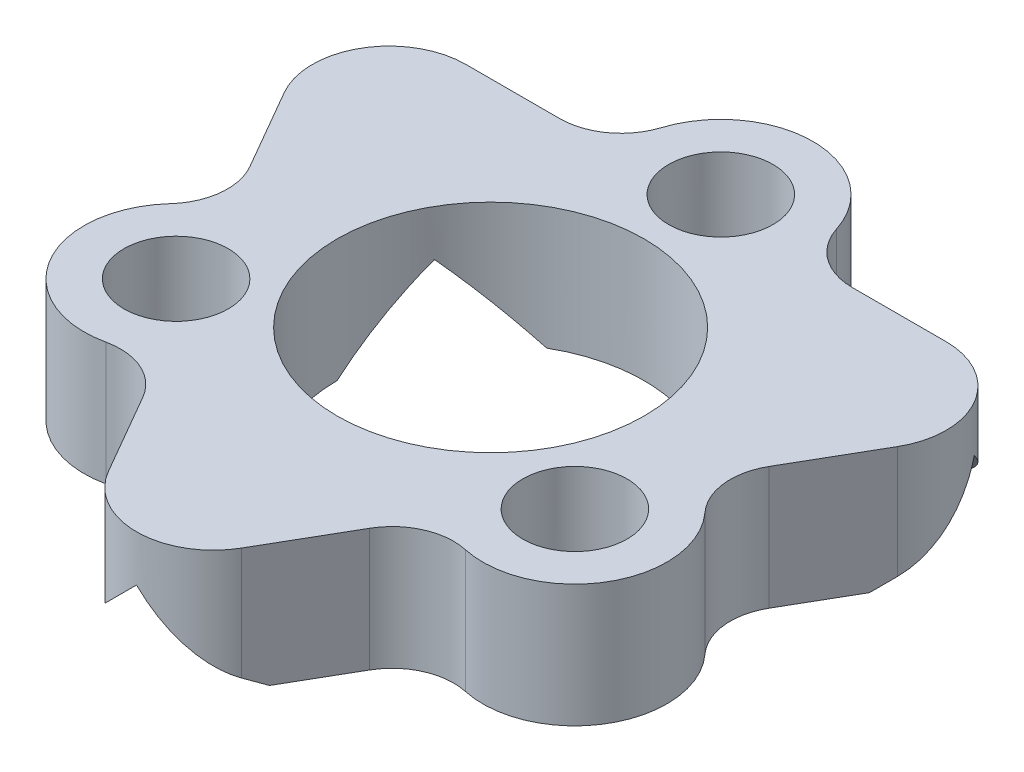
ISO-10303-21;
HEADER;
FILE_DESCRIPTION(('STEP AP214'),'2;1');
FILE_NAME('part.step','',(''),(''),'','','');
FILE_SCHEMA(('AUTOMOTIVE_DESIGN { 1 0 10303 214 1 1 1 1 }'));
ENDSEC;
DATA;
#1=APPLICATION_CONTEXT('core data for automotive mechanical design processes');
#2=APPLICATION_PROTOCOL_DEFINITION('international standard','automotive_design',2000,#1);
#3=PRODUCT_CONTEXT('',#1,'mechanical');
#4=PRODUCT('Part','Part','',(#3));
#5=PRODUCT_RELATED_PRODUCT_CATEGORY('part','',(#4));
#6=PRODUCT_DEFINITION_FORMATION('','',#4);
#7=PRODUCT_DEFINITION_CONTEXT('part definition',#1,'design');
#8=PRODUCT_DEFINITION('design','',#6,#7);
#9=PRODUCT_DEFINITION_SHAPE('','',#8);
#10=(LENGTH_UNIT() NAMED_UNIT(*) SI_UNIT(.MILLI.,.METRE.));
#11=(NAMED_UNIT(*) PLANE_ANGLE_UNIT() SI_UNIT($,.RADIAN.));
#12=(NAMED_UNIT(*) SI_UNIT($,.STERADIAN.) SOLID_ANGLE_UNIT());
#13=UNCERTAINTY_MEASURE_WITH_UNIT(LENGTH_MEASURE(1.E-05),#10,'distance_accuracy_value','');
#14=(GEOMETRIC_REPRESENTATION_CONTEXT(3) GLOBAL_UNCERTAINTY_ASSIGNED_CONTEXT((#13)) GLOBAL_UNIT_ASSIGNED_CONTEXT((#10,
#11,#12)) REPRESENTATION_CONTEXT('',''));
#15=CARTESIAN_POINT('',(0.,0.,0.));
#16=DIRECTION('',(0.,0.,1.));
#17=DIRECTION('',(1.,0.,0.));
#18=AXIS2_PLACEMENT_3D('',#15,#16,#17);
#19=CARTESIAN_POINT('',(11.5265487560121,0.,8.75540769010716));
#20=DIRECTION('',(0.,-1.,0.));
#21=DIRECTION('',(0.,0.,-1.));
#22=AXIS2_PLACEMENT_3D('',#19,#20,#21);
#23=PLANE('',#22);
#24=DIRECTION('',(0.866025403784443,0.,-0.499999999999992));
#25=VECTOR('',#24,1.);
#26=CARTESIAN_POINT('',(8.59904588082546,0.,-4.20939363476538));
#27=LINE('',#26,#25);
#28=CARTESIAN_POINT('',(8.59904588082546,0.,-4.20939363476538));
#29=VERTEX_POINT('',#28);
#30=CARTESIAN_POINT('',(13.2540458808258,0.,-6.89695913784322));
#31=VERTEX_POINT('',#30);
#32=EDGE_CURVE('E226',#29,#31,#27,.T.);
#33=ORIENTED_EDGE('',*,*,#32,.F.);
#34=CARTESIAN_POINT('',(6.09904588082545,0.,0.120733384156847));
#35=DIRECTION('',(0.,1.,0.));
#36=DIRECTION('',(0.,0.,1.));
#37=AXIS2_PLACEMENT_3D('',#34,#35,#36);
#38=CIRCLE('',#37,5.00000000000003);
#39=CARTESIAN_POINT('',(3.59904588082543,0.,-4.20939363476537));
#40=VERTEX_POINT('',#39);
#41=EDGE_CURVE('E222',#29,#40,#38,.T.);
#42=ORIENTED_EDGE('',*,*,#41,.T.);
#43=DIRECTION('',(-0.866025403784436,0.,-0.500000000000004));
#44=VECTOR('',#43,1.);
#45=CARTESIAN_POINT('',(3.59904588082543,0.,-4.20939363476537));
#46=LINE('',#45,#44);
#47=CARTESIAN_POINT('',(-1.05595411917466,0.,-6.89695913784316));
#48=VERTEX_POINT('',#47);
#49=EDGE_CURVE('E261',#40,#48,#46,.T.);
#50=ORIENTED_EDGE('',*,*,#49,.T.);
#51=DIRECTION('',(-1.,0.,0.));
#52=VECTOR('',#51,1.);
#53=CARTESIAN_POINT('',(1.33495001606111,0.,-6.89695913784322));
#54=LINE('',#53,#52);
#55=CARTESIAN_POINT('',(1.33495001606111,0.,-6.89695913784322));
#56=VERTEX_POINT('',#55);
#57=EDGE_CURVE('E381',#56,#48,#54,.T.);
#58=ORIENTED_EDGE('',*,*,#57,.F.);
#59=CARTESIAN_POINT('',(1.33495001606111,0.,-8.89695913784322));
#60=DIRECTION('',(0.,-1.,0.));
#61=DIRECTION('',(0.,0.,1.));
#62=AXIS2_PLACEMENT_3D('',#59,#60,#61);
#63=CIRCLE('',#62,2.);
#64=CARTESIAN_POINT('',(3.24058836196686,0.,-8.28988212904319));
#65=VERTEX_POINT('',#64);
#66=EDGE_CURVE('E379',#65,#56,#63,.T.);
#67=ORIENTED_EDGE('',*,*,#66,.F.);
#68=CARTESIAN_POINT('',(6.09904588082545,0.,-7.37926661584315));
#69=DIRECTION('',(0.,1.,0.));
#70=DIRECTION('',(0.,0.,-1.));
#71=AXIS2_PLACEMENT_3D('',#68,#69,#70);
#72=CIRCLE('',#71,3.);
#73=CARTESIAN_POINT('',(8.95750339968408,0.,-8.28988212904318));
#74=VERTEX_POINT('',#73);
#75=EDGE_CURVE('E377',#74,#65,#72,.T.);
#76=ORIENTED_EDGE('',*,*,#75,.F.);
#77=CARTESIAN_POINT('',(10.8631417455899,0.,-8.89695913784322));
#78=DIRECTION('',(0.,-1.,0.));
#79=DIRECTION('',(0.,0.,-1.));
#80=AXIS2_PLACEMENT_3D('',#77,#78,#79);
#81=CIRCLE('',#80,2.);
#82=CARTESIAN_POINT('',(10.8631417455899,0.,-6.89695913784322));
#83=VERTEX_POINT('',#82);
#84=EDGE_CURVE('E375',#83,#74,#81,.T.);
#85=ORIENTED_EDGE('',*,*,#84,.F.);
#86=DIRECTION('',(-1.,0.,0.));
#87=VECTOR('',#86,1.);
#88=CARTESIAN_POINT('',(13.9239188619028,0.,-6.89695913784322));
#89=LINE('',#88,#87);
#90=EDGE_CURVE('E373',#31,#83,#89,.T.);
#91=ORIENTED_EDGE('',*,*,#90,.F.);
#92=EDGE_LOOP('',(#33,#42,#50,#58,#67,#76,#85,#91));
#93=FACE_BOUND('',#92,.T.);
#94=CARTESIAN_POINT('',(6.09904588082547,0.,-7.37926661584312));
#95=DIRECTION('',(0.,-1.,0.));
#96=DIRECTION('',(0.,0.,-1.));
#97=AXIS2_PLACEMENT_3D('',#94,#95,#96);
#98=CIRCLE('',#97,1.7);
#99=CARTESIAN_POINT('',(6.09904588082547,0.,-9.07926661584312));
#100=VERTEX_POINT('',#99);
#101=EDGE_CURVE('E314',#100,#100,#98,.T.);
#102=ORIENTED_EDGE('',*,*,#101,.F.);
#103=EDGE_LOOP('',(#102));
#104=FACE_BOUND('',#103,.T.);
#105=ADVANCED_FACE('F31',(#93,#104),#23,.T.);
#106=DIRECTION('',(-0.866025403784436,0.,-0.500000000000004));
#107=VECTOR('',#106,1.);
#108=CARTESIAN_POINT('',(1.09904588082542,0.,0.120733384156839));
#109=LINE('',#108,#107);
#110=CARTESIAN_POINT('',(1.09904588082542,0.,0.120733384156841));
#111=VERTEX_POINT('',#110);
#112=CARTESIAN_POINT('',(-3.55595411917464,0.,-2.56683211892093));
#113=VERTEX_POINT('',#112);
#114=EDGE_CURVE('E253',#111,#113,#109,.T.);
#115=ORIENTED_EDGE('',*,*,#114,.F.);
#116=CARTESIAN_POINT('',(3.59904588082539,0.,4.45086040307904));
#117=VERTEX_POINT('',#116);
#118=EDGE_CURVE('E325',#111,#117,#38,.T.);
#119=ORIENTED_EDGE('',*,*,#118,.T.);
#120=DIRECTION('',(0.,0.,1.));
#121=VECTOR('',#120,1.);
#122=CARTESIAN_POINT('',(3.59904588082539,0.,4.45086040307904));
#123=LINE('',#122,#121);
#124=CARTESIAN_POINT('',(3.59904588082539,0.,9.82599140923435));
#125=VERTEX_POINT('',#124);
#126=EDGE_CURVE('E292',#117,#125,#123,.T.);
#127=ORIENTED_EDGE('',*,*,#126,.T.);
#128=DIRECTION('',(0.500000000000002,0.,0.866025403784437));
#129=VECTOR('',#128,1.);
#130=CARTESIAN_POINT('',(2.40359381320767,0.,7.75540769010721));
#131=LINE('',#130,#129);
#132=CARTESIAN_POINT('',(2.40359381320767,0.,7.75540769010721));
#133=VERTEX_POINT('',#132);
#134=EDGE_CURVE('E392',#133,#125,#131,.T.);
#135=ORIENTED_EDGE('',*,*,#134,.F.);
#136=CARTESIAN_POINT('',(0.671543005638805,0.,8.75540769010719));
#137=DIRECTION('',(0.,-1.,0.));
#138=DIRECTION('',(0.,0.,1.));
#139=AXIS2_PLACEMENT_3D('',#136,#137,#138);
#140=CIRCLE('',#139,1.99999999999998);
#141=CARTESIAN_POINT('',(0.24446794436015,0.,6.80153796772708));
#142=VERTEX_POINT('',#141);
#143=EDGE_CURVE('E390',#142,#133,#140,.T.);
#144=ORIENTED_EDGE('',*,*,#143,.F.);
#145=CARTESIAN_POINT('',(-0.396144647557801,0.,3.87073338415684));
#146=DIRECTION('',(0.,1.,0.));
#147=DIRECTION('',(0.,0.,-1.));
#148=AXIS2_PLACEMENT_3D('',#145,#146,#147);
#149=CIRCLE('',#148,3.00000000000001);
#150=CARTESIAN_POINT('',(-2.61398957449853,0.,1.85054431378662));
#151=VERTEX_POINT('',#150);
#152=EDGE_CURVE('E388',#151,#142,#149,.T.);
#153=ORIENTED_EDGE('',*,*,#152,.F.);
#154=CARTESIAN_POINT('',(-4.09255285912562,0.,0.503751600206422));
#155=DIRECTION('',(0.,-1.,0.));
#156=DIRECTION('',(0.,0.,-1.));
#157=AXIS2_PLACEMENT_3D('',#154,#155,#156);
#158=CIRCLE('',#157,1.99999999999998);
#159=CARTESIAN_POINT('',(-2.36050205155676,0.,-0.49624839979356));
#160=VERTEX_POINT('',#159);
#161=EDGE_CURVE('E386',#160,#151,#158,.T.);
#162=ORIENTED_EDGE('',*,*,#161,.F.);
#163=DIRECTION('',(0.500000000000003,0.,0.866025403784437));
#164=VECTOR('',#163,1.);
#165=CARTESIAN_POINT('',(-3.8908906097135,0.,-3.14695913784305));
#166=LINE('',#165,#164);
#167=EDGE_CURVE('E384',#113,#160,#166,.T.);
#168=ORIENTED_EDGE('',*,*,#167,.F.);
#169=EDGE_LOOP('',(#115,#119,#127,#135,#144,#153,#162,#168));
#170=FACE_BOUND('',#169,.T.);
#171=CARTESIAN_POINT('',(-0.396144647557801,0.,3.87073338415684));
#172=DIRECTION('',(0.,-1.,0.));
#173=DIRECTION('',(0.,0.,-1.));
#174=AXIS2_PLACEMENT_3D('',#171,#172,#173);
#175=CIRCLE('',#174,1.7);
#176=CARTESIAN_POINT('',(-0.396144647557801,0.,2.17073338415685));
#177=VERTEX_POINT('',#176);
#178=EDGE_CURVE('E318',#177,#177,#175,.T.);
#179=ORIENTED_EDGE('',*,*,#178,.F.);
#180=EDGE_LOOP('',(#179));
#181=FACE_BOUND('',#180,.T.);
#182=ADVANCED_FACE('F452',(#170,#181),#23,.T.);
#183=CARTESIAN_POINT('',(11.5265487560121,4.,8.75540769010716));
#184=DIRECTION('',(0.,-1.,0.));
#185=DIRECTION('',(0.,0.,-1.));
#186=AXIS2_PLACEMENT_3D('',#183,#184,#185);
#187=PLANE('',#186);
#188=CARTESIAN_POINT('',(6.09904588082547,4.,-7.37926661584312));
#189=DIRECTION('',(0.,1.,0.));
#190=DIRECTION('',(0.,0.,1.));
#191=AXIS2_PLACEMENT_3D('',#188,#189,#190);
#192=CIRCLE('',#191,1.7);
#193=CARTESIAN_POINT('',(6.09904588082547,4.,-5.67926661584313));
#194=VERTEX_POINT('',#193);
#195=EDGE_CURVE('E311',#194,#194,#192,.T.);
#196=ORIENTED_EDGE('',*,*,#195,.F.);
#197=EDGE_LOOP('',(#196));
#198=FACE_BOUND('',#197,.T.);
#199=CARTESIAN_POINT('',(-0.396144647557801,4.,3.87073338415684));
#200=DIRECTION('',(0.,1.,0.));
#201=DIRECTION('',(0.,0.,1.));
#202=AXIS2_PLACEMENT_3D('',#199,#200,#201);
#203=CIRCLE('',#202,1.7);
#204=CARTESIAN_POINT('',(-0.396144647557801,4.,5.57073338415684));
#205=VERTEX_POINT('',#204);
#206=EDGE_CURVE('E315',#205,#205,#203,.T.);
#207=ORIENTED_EDGE('',*,*,#206,.F.);
#208=EDGE_LOOP('',(#207));
#209=FACE_BOUND('',#208,.T.);
#210=CARTESIAN_POINT('',(11.5265487560121,4.,8.75540769010716));
#211=DIRECTION('',(0.,-1.,0.));
#212=DIRECTION('',(0.,0.,-1.));
#213=AXIS2_PLACEMENT_3D('',#210,#211,#212);
#214=CIRCLE('',#213,2.00000000000007);
#215=CARTESIAN_POINT('',(9.79449794844298,4.,7.75540769010717));
#216=VERTEX_POINT('',#215);
#217=CARTESIAN_POINT('',(11.9536238172906,4.,6.80153796772693));
#218=VERTEX_POINT('',#217);
#219=EDGE_CURVE('E326',#216,#218,#214,.T.);
#220=ORIENTED_EDGE('',*,*,#219,.T.);
#221=CARTESIAN_POINT('',(12.5942364092088,4.,3.87073338415675));
#222=DIRECTION('',(0.,1.,0.));
#223=DIRECTION('',(0.,0.,-1.));
#224=AXIS2_PLACEMENT_3D('',#221,#222,#223);
#225=CIRCLE('',#224,3.00000000000001);
#226=CARTESIAN_POINT('',(14.8120813361492,4.,1.85054431378651));
#227=VERTEX_POINT('',#226);
#228=EDGE_CURVE('E329',#218,#227,#225,.T.);
#229=ORIENTED_EDGE('',*,*,#228,.T.);
#230=CARTESIAN_POINT('',(16.2906446207765,4.,0.5037516002063));
#231=DIRECTION('',(0.,-1.,0.));
#232=DIRECTION('',(0.,0.,-1.));
#233=AXIS2_PLACEMENT_3D('',#230,#231,#232);
#234=CIRCLE('',#233,2.00000000000014);
#235=CARTESIAN_POINT('',(14.5585938132074,4.,-0.496248399793797));
#236=VERTEX_POINT('',#235);
#237=EDGE_CURVE('E332',#227,#236,#234,.T.);
#238=ORIENTED_EDGE('',*,*,#237,.T.);
#239=DIRECTION('',(0.499999999999995,0.,-0.866025403784441));
#240=VECTOR('',#239,1.);
#241=CARTESIAN_POINT('',(14.5585938132074,4.,-0.496248399793797));
#242=LINE('',#241,#240);
#243=CARTESIAN_POINT('',(16.088982371364,4.,-3.14695913784307));
#244=VERTEX_POINT('',#243);
#245=EDGE_CURVE('E334',#236,#244,#242,.T.);
#246=ORIENTED_EDGE('',*,*,#245,.T.);
#247=CARTESIAN_POINT('',(13.9239188619028,4.,-4.39695913784311));
#248=DIRECTION('',(0.,1.,0.));
#249=DIRECTION('',(0.,0.,-1.));
#250=AXIS2_PLACEMENT_3D('',#247,#248,#249);
#251=CIRCLE('',#250,2.50000000000011);
#252=CARTESIAN_POINT('',(13.9239188619028,4.,-6.89695913784322));
#253=VERTEX_POINT('',#252);
#254=EDGE_CURVE('E336',#244,#253,#251,.T.);
#255=ORIENTED_EDGE('',*,*,#254,.T.);
#256=DIRECTION('',(-1.,0.,0.));
#257=VECTOR('',#256,1.);
#258=CARTESIAN_POINT('',(13.9239188619028,4.,-6.89695913784322));
#259=LINE('',#258,#257);
#260=CARTESIAN_POINT('',(10.8631417455899,4.,-6.89695913784322));
#261=VERTEX_POINT('',#260);
#262=EDGE_CURVE('E338',#253,#261,#259,.T.);
#263=ORIENTED_EDGE('',*,*,#262,.T.);
#264=CARTESIAN_POINT('',(10.8631417455899,4.,-8.89695913784322));
#265=DIRECTION('',(0.,-1.,0.));
#266=DIRECTION('',(0.,0.,-1.));
#267=AXIS2_PLACEMENT_3D('',#264,#265,#266);
#268=CIRCLE('',#267,2.);
#269=CARTESIAN_POINT('',(8.95750339968408,4.,-8.28988212904318));
#270=VERTEX_POINT('',#269);
#271=EDGE_CURVE('E340',#261,#270,#268,.T.);
#272=ORIENTED_EDGE('',*,*,#271,.T.);
#273=CARTESIAN_POINT('',(6.09904588082545,4.,-7.37926661584315));
#274=DIRECTION('',(0.,1.,0.));
#275=DIRECTION('',(0.,0.,-1.));
#276=AXIS2_PLACEMENT_3D('',#273,#274,#275);
#277=CIRCLE('',#276,3.);
#278=CARTESIAN_POINT('',(3.24058836196686,4.,-8.28988212904319));
#279=VERTEX_POINT('',#278);
#280=EDGE_CURVE('E342',#270,#279,#277,.T.);
#281=ORIENTED_EDGE('',*,*,#280,.T.);
#282=CARTESIAN_POINT('',(1.33495001606111,4.,-8.89695913784322));
#283=DIRECTION('',(0.,-1.,0.));
#284=DIRECTION('',(0.,0.,1.));
#285=AXIS2_PLACEMENT_3D('',#282,#283,#284);
#286=CIRCLE('',#285,2.);
#287=CARTESIAN_POINT('',(1.33495001606111,4.,-6.89695913784322));
#288=VERTEX_POINT('',#287);
#289=EDGE_CURVE('E344',#279,#288,#286,.T.);
#290=ORIENTED_EDGE('',*,*,#289,.T.);
#291=DIRECTION('',(-1.,0.,0.));
#292=VECTOR('',#291,1.);
#293=CARTESIAN_POINT('',(1.33495001606111,4.,-6.89695913784322));
#294=LINE('',#293,#292);
#295=CARTESIAN_POINT('',(-1.72582710025211,4.,-6.89695913784318));
#296=VERTEX_POINT('',#295);
#297=EDGE_CURVE('E346',#288,#296,#294,.T.);
#298=ORIENTED_EDGE('',*,*,#297,.T.);
#299=CARTESIAN_POINT('',(-1.72582710025231,4.,-4.39695913784311));
#300=DIRECTION('',(0.,1.,0.));
#301=DIRECTION('',(0.,0.,-1.));
#302=AXIS2_PLACEMENT_3D('',#299,#300,#301);
#303=CIRCLE('',#302,2.50000000000007);
#304=CARTESIAN_POINT('',(-3.8908906097135,4.,-3.14695913784305));
#305=VERTEX_POINT('',#304);
#306=EDGE_CURVE('E348',#296,#305,#303,.T.);
#307=ORIENTED_EDGE('',*,*,#306,.T.);
#308=DIRECTION('',(0.500000000000003,0.,0.866025403784437));
#309=VECTOR('',#308,1.);
#310=CARTESIAN_POINT('',(-3.8908906097135,4.,-3.14695913784305));
#311=LINE('',#310,#309);
#312=CARTESIAN_POINT('',(-2.36050205155676,4.,-0.49624839979356));
#313=VERTEX_POINT('',#312);
#314=EDGE_CURVE('E350',#305,#313,#311,.T.);
#315=ORIENTED_EDGE('',*,*,#314,.T.);
#316=CARTESIAN_POINT('',(-4.09255285912562,4.,0.503751600206422));
#317=DIRECTION('',(0.,-1.,0.));
#318=DIRECTION('',(0.,0.,-1.));
#319=AXIS2_PLACEMENT_3D('',#316,#317,#318);
#320=CIRCLE('',#319,1.99999999999998);
#321=CARTESIAN_POINT('',(-2.61398957449853,4.,1.85054431378662));
#322=VERTEX_POINT('',#321);
#323=EDGE_CURVE('E352',#313,#322,#320,.T.);
#324=ORIENTED_EDGE('',*,*,#323,.T.);
#325=CARTESIAN_POINT('',(-0.396144647557801,4.,3.87073338415684));
#326=DIRECTION('',(0.,1.,0.));
#327=DIRECTION('',(0.,0.,-1.));
#328=AXIS2_PLACEMENT_3D('',#325,#326,#327);
#329=CIRCLE('',#328,3.00000000000001);
#330=CARTESIAN_POINT('',(0.24446794436015,4.,6.80153796772708));
#331=VERTEX_POINT('',#330);
#332=EDGE_CURVE('E354',#322,#331,#329,.T.);
#333=ORIENTED_EDGE('',*,*,#332,.T.);
#334=CARTESIAN_POINT('',(0.671543005638805,4.,8.75540769010719));
#335=DIRECTION('',(0.,-1.,0.));
#336=DIRECTION('',(0.,0.,1.));
#337=AXIS2_PLACEMENT_3D('',#334,#335,#336);
#338=CIRCLE('',#337,1.99999999999998);
#339=CARTESIAN_POINT('',(2.40359381320767,4.,7.75540769010721));
#340=VERTEX_POINT('',#339);
#341=EDGE_CURVE('E356',#331,#340,#338,.T.);
#342=ORIENTED_EDGE('',*,*,#341,.T.);
#343=DIRECTION('',(0.500000000000002,0.,0.866025403784437));
#344=VECTOR('',#343,1.);
#345=CARTESIAN_POINT('',(2.40359381320767,4.,7.75540769010721));
#346=LINE('',#345,#344);
#347=CARTESIAN_POINT('',(3.93398237136423,4.,10.4061184281562));
#348=VERTEX_POINT('',#347);
#349=EDGE_CURVE('E358',#340,#348,#346,.T.);
#350=ORIENTED_EDGE('',*,*,#349,.T.);
#351=CARTESIAN_POINT('',(6.09904588082544,4.,9.15611842815633));
#352=DIRECTION('',(0.,1.,0.));
#353=DIRECTION('',(0.,0.,-1.));
#354=AXIS2_PLACEMENT_3D('',#351,#352,#353);
#355=CIRCLE('',#354,2.50000000000005);
#356=CARTESIAN_POINT('',(8.26410939028653,4.,10.4061184281562));
#357=VERTEX_POINT('',#356);
#358=EDGE_CURVE('E360',#348,#357,#355,.T.);
#359=ORIENTED_EDGE('',*,*,#358,.T.);
#360=DIRECTION('',(0.499999999999994,0.,-0.866025403784442));
#361=VECTOR('',#360,1.);
#362=CARTESIAN_POINT('',(8.26410939028653,4.,10.4061184281562));
#363=LINE('',#362,#361);
#364=EDGE_CURVE('E362',#357,#216,#363,.T.);
#365=ORIENTED_EDGE('',*,*,#364,.T.);
#366=EDGE_LOOP('',(#220,#229,#238,#246,#255,#263,#272,#281,#290,#298,#307,#315,#324,#333,#342,
#350,#359,#365));
#367=FACE_BOUND('',#366,.T.);
#368=CARTESIAN_POINT('',(6.09904588082545,4.,0.120733384156847));
#369=DIRECTION('',(0.,1.,0.));
#370=DIRECTION('',(0.,0.,1.));
#371=AXIS2_PLACEMENT_3D('',#368,#369,#370);
#372=CIRCLE('',#371,5.00000000000003);
#373=CARTESIAN_POINT('',(6.09904588082545,4.,5.12073338415688));
#374=VERTEX_POINT('',#373);
#375=EDGE_CURVE('E319',#374,#374,#372,.T.);
#376=ORIENTED_EDGE('',*,*,#375,.F.);
#377=EDGE_LOOP('',(#376));
#378=FACE_BOUND('',#377,.T.);
#379=CARTESIAN_POINT('',(12.5942364092087,4.,3.87073338415688));
#380=DIRECTION('',(0.,1.,0.));
#381=DIRECTION('',(0.,0.,1.));
#382=AXIS2_PLACEMENT_3D('',#379,#380,#381);
#383=CIRCLE('',#382,1.7);
#384=CARTESIAN_POINT('',(12.5942364092087,4.,5.57073338415687));
#385=VERTEX_POINT('',#384);
#386=EDGE_CURVE('E308',#385,#385,#383,.T.);
#387=ORIENTED_EDGE('',*,*,#386,.F.);
#388=EDGE_LOOP('',(#387));
#389=FACE_BOUND('',#388,.T.);
#390=ADVANCED_FACE('F459',(#198,#209,#367,#378,#389),#187,.F.);
#391=DIRECTION('',(0.866025403784443,0.,-0.499999999999992));
#392=VECTOR('',#391,1.);
#393=CARTESIAN_POINT('',(11.0990458808255,0.,0.120733384156822));
#394=LINE('',#393,#392);
#395=CARTESIAN_POINT('',(11.0990458808255,0.,0.120733384156825));
#396=VERTEX_POINT('',#395);
#397=CARTESIAN_POINT('',(15.7540458808249,0.,-2.56683211892047));
#398=VERTEX_POINT('',#397);
#399=EDGE_CURVE('E48',#396,#398,#394,.T.);
#400=ORIENTED_EDGE('',*,*,#399,.T.);
#401=DIRECTION('',(0.499999999999995,0.,-0.866025403784441));
#402=VECTOR('',#401,1.);
#403=CARTESIAN_POINT('',(14.5585938132074,0.,-0.496248399793797));
#404=LINE('',#403,#402);
#405=CARTESIAN_POINT('',(14.5585938132074,0.,-0.496248399793797));
#406=VERTEX_POINT('',#405);
#407=EDGE_CURVE('E371',#406,#398,#404,.T.);
#408=ORIENTED_EDGE('',*,*,#407,.F.);
#409=CARTESIAN_POINT('',(16.2906446207765,0.,0.5037516002063));
#410=DIRECTION('',(0.,-1.,0.));
#411=DIRECTION('',(0.,0.,-1.));
#412=AXIS2_PLACEMENT_3D('',#409,#410,#411);
#413=CIRCLE('',#412,2.00000000000014);
#414=CARTESIAN_POINT('',(14.8120813361492,0.,1.85054431378651));
#415=VERTEX_POINT('',#414);
#416=EDGE_CURVE('E369',#415,#406,#413,.T.);
#417=ORIENTED_EDGE('',*,*,#416,.F.);
#418=CARTESIAN_POINT('',(12.5942364092088,0.,3.87073338415675));
#419=DIRECTION('',(0.,1.,0.));
#420=DIRECTION('',(0.,0.,-1.));
#421=AXIS2_PLACEMENT_3D('',#418,#419,#420);
#422=CIRCLE('',#421,3.00000000000001);
#423=CARTESIAN_POINT('',(11.9536238172906,0.,6.80153796772693));
#424=VERTEX_POINT('',#423);
#425=EDGE_CURVE('E367',#424,#415,#422,.T.);
#426=ORIENTED_EDGE('',*,*,#425,.F.);
#427=CARTESIAN_POINT('',(11.5265487560121,0.,8.75540769010716));
#428=DIRECTION('',(0.,-1.,0.));
#429=DIRECTION('',(0.,0.,-1.));
#430=AXIS2_PLACEMENT_3D('',#427,#428,#429);
#431=CIRCLE('',#430,2.00000000000007);
#432=CARTESIAN_POINT('',(9.79449794844298,0.,7.75540769010717));
#433=VERTEX_POINT('',#432);
#434=EDGE_CURVE('E322',#433,#424,#431,.T.);
#435=ORIENTED_EDGE('',*,*,#434,.F.);
#436=DIRECTION('',(0.499999999999994,0.,-0.866025403784442));
#437=VECTOR('',#436,1.);
#438=CARTESIAN_POINT('',(8.26410939028653,0.,10.4061184281562));
#439=LINE('',#438,#437);
#440=CARTESIAN_POINT('',(8.59904588082541,0.,9.82599140923409));
#441=VERTEX_POINT('',#440);
#442=EDGE_CURVE('E330',#441,#433,#439,.T.);
#443=ORIENTED_EDGE('',*,*,#442,.F.);
#444=DIRECTION('',(0.,0.,1.));
#445=VECTOR('',#444,1.);
#446=CARTESIAN_POINT('',(8.59904588082541,0.,4.4508604030791));
#447=LINE('',#446,#445);
#448=CARTESIAN_POINT('',(8.59904588082541,0.,4.4508604030791));
#449=VERTEX_POINT('',#448);
#450=EDGE_CURVE('E283',#449,#441,#447,.T.);
#451=ORIENTED_EDGE('',*,*,#450,.F.);
#452=EDGE_CURVE('E323',#449,#396,#38,.T.);
#453=ORIENTED_EDGE('',*,*,#452,.T.);
#454=EDGE_LOOP('',(#400,#408,#417,#426,#435,#443,#451,#453));
#455=FACE_BOUND('',#454,.T.);
#456=CARTESIAN_POINT('',(12.5942364092087,0.,3.87073338415688));
#457=DIRECTION('',(0.,-1.,0.));
#458=DIRECTION('',(0.,0.,-1.));
#459=AXIS2_PLACEMENT_3D('',#456,#457,#458);
#460=CIRCLE('',#459,1.7);
#461=CARTESIAN_POINT('',(12.5942364092087,0.,2.17073338415688));
#462=VERTEX_POINT('',#461);
#463=EDGE_CURVE('E35',#462,#462,#460,.T.);
#464=ORIENTED_EDGE('',*,*,#463,.F.);
#465=EDGE_LOOP('',(#464));
#466=FACE_BOUND('',#465,.T.);
#467=ADVANCED_FACE('F455',(#455,#466),#23,.T.);
#468=CARTESIAN_POINT('',(11.5265487560121,4.,8.75540769010716));
#469=DIRECTION('',(0.,-1.,0.));
#470=DIRECTION('',(0.,0.,-1.));
#471=AXIS2_PLACEMENT_3D('',#468,#469,#470);
#472=CYLINDRICAL_SURFACE('',#471,2.00000000000007);
#473=ORIENTED_EDGE('',*,*,#434,.T.);
#474=DIRECTION('',(0.,-1.,0.));
#475=VECTOR('',#474,1.);
#476=CARTESIAN_POINT('',(11.9536238172906,4.,6.80153796772693));
#477=LINE('',#476,#475);
#478=EDGE_CURVE('E11',#218,#424,#477,.T.);
#479=ORIENTED_EDGE('',*,*,#478,.F.);
#480=ORIENTED_EDGE('',*,*,#219,.F.);
#481=DIRECTION('',(0.,-1.,0.));
#482=VECTOR('',#481,1.);
#483=CARTESIAN_POINT('',(9.79449794844298,4.,7.75540769010717));
#484=LINE('',#483,#482);
#485=EDGE_CURVE('E364',#216,#433,#484,.T.);
#486=ORIENTED_EDGE('',*,*,#485,.T.);
#487=EDGE_LOOP('',(#473,#479,#480,#486));
#488=FACE_BOUND('',#487,.T.);
#489=ADVANCED_FACE('F33',(#488),#472,.F.);
#490=CARTESIAN_POINT('',(12.5942364092088,4.,3.87073338415675));
#491=DIRECTION('',(0.,-1.,0.));
#492=DIRECTION('',(0.,0.,-1.));
#493=AXIS2_PLACEMENT_3D('',#490,#491,#492);
#494=CYLINDRICAL_SURFACE('',#493,3.00000000000001);
#495=ORIENTED_EDGE('',*,*,#425,.T.);
#496=DIRECTION('',(0.,-1.,0.));
#497=VECTOR('',#496,1.);
#498=CARTESIAN_POINT('',(14.8120813361492,4.,1.85054431378651));
#499=LINE('',#498,#497);
#500=EDGE_CURVE('E40',#227,#415,#499,.T.);
#501=ORIENTED_EDGE('',*,*,#500,.F.);
#502=ORIENTED_EDGE('',*,*,#228,.F.);
#503=ORIENTED_EDGE('',*,*,#478,.T.);
#504=EDGE_LOOP('',(#495,#501,#502,#503));
#505=FACE_BOUND('',#504,.T.);
#506=ADVANCED_FACE('F468',(#505),#494,.T.);
#507=CARTESIAN_POINT('',(16.2906446207765,4.,0.5037516002063));
#508=DIRECTION('',(0.,-1.,0.));
#509=DIRECTION('',(0.,0.,-1.));
#510=AXIS2_PLACEMENT_3D('',#507,#508,#509);
#511=CYLINDRICAL_SURFACE('',#510,2.00000000000014);
#512=ORIENTED_EDGE('',*,*,#416,.T.);
#513=DIRECTION('',(0.,-1.,0.));
#514=VECTOR('',#513,1.);
#515=CARTESIAN_POINT('',(14.5585938132074,4.,-0.496248399793797));
#516=LINE('',#515,#514);
#517=EDGE_CURVE('E439',#236,#406,#516,.T.);
#518=ORIENTED_EDGE('',*,*,#517,.F.);
#519=ORIENTED_EDGE('',*,*,#237,.F.);
#520=ORIENTED_EDGE('',*,*,#500,.T.);
#521=EDGE_LOOP('',(#512,#518,#519,#520));
#522=FACE_BOUND('',#521,.T.);
#523=ADVANCED_FACE('F559',(#522),#511,.F.);
#524=CARTESIAN_POINT('',(14.5585938132074,4.,-0.496248399793797));
#525=DIRECTION('',(-0.866025403784441,0.,-0.499999999999995));
#526=DIRECTION('',(-0.499999999999995,0.,0.866025403784441));
#527=AXIS2_PLACEMENT_3D('',#524,#525,#526);
#528=PLANE('',#527);
#529=ORIENTED_EDGE('',*,*,#407,.T.);
#530=DIRECTION('',(0.44721359549995,0.447213595499973,-0.774596669241479));
#531=VECTOR('',#530,1.);
#532=CARTESIAN_POINT('',(15.597684226731,-0.156361654093919,-2.2960057896743));
#533=LINE('',#532,#531);
#534=CARTESIAN_POINT('',(16.088982371364,0.334936490539154,-3.14695913784307));
#535=VERTEX_POINT('',#534);
#536=EDGE_CURVE('E242',#398,#535,#533,.T.);
#537=ORIENTED_EDGE('',*,*,#536,.T.);
#538=DIRECTION('',(0.,-1.,0.));
#539=VECTOR('',#538,1.);
#540=CARTESIAN_POINT('',(16.088982371364,4.,-3.14695913784307));
#541=LINE('',#540,#539);
#542=EDGE_CURVE('E437',#244,#535,#541,.T.);
#543=ORIENTED_EDGE('',*,*,#542,.F.);
#544=ORIENTED_EDGE('',*,*,#245,.F.);
#545=ORIENTED_EDGE('',*,*,#517,.T.);
#546=EDGE_LOOP('',(#529,#537,#543,#544,#545));
#547=FACE_BOUND('',#546,.T.);
#548=ADVANCED_FACE('F556',(#547),#528,.F.);
#549=CARTESIAN_POINT('',(13.9239188619028,4.,-4.39695913784311));
#550=DIRECTION('',(0.,-1.,0.));
#551=DIRECTION('',(0.,0.,-1.));
#552=AXIS2_PLACEMENT_3D('',#549,#550,#551);
#553=CYLINDRICAL_SURFACE('',#552,2.50000000000011);
#554=CARTESIAN_POINT('',(13.9239188619028,2.50000000000037,-4.39695913784311));
#555=DIRECTION('',(0.353553390593271,0.707106781186541,0.612372435695803));
#556=DIRECTION('',(0.353553390593265,-0.707106781186554,0.612372435695792));
#557=AXIS2_PLACEMENT_3D('',#554,#555,#556);
#558=ELLIPSE('',#557,3.53553390593293,2.50000000000011);
#559=CARTESIAN_POINT('',(16.0889823713642,2.5,-5.64695913784283));
#560=VERTEX_POINT('',#559);
#561=EDGE_CURVE('E56',#535,#560,#558,.T.);
#562=ORIENTED_EDGE('',*,*,#561,.T.);
#563=CARTESIAN_POINT('',(13.9239188619028,2.49999999999963,-4.39695913784311));
#564=DIRECTION('',(-0.353553390593264,0.707106781186556,-0.61237243569579));
#565=DIRECTION('',(-0.353553390593273,-0.707106781186539,-0.612372435695806));
#566=AXIS2_PLACEMENT_3D('',#563,#564,#565);
#567=ELLIPSE('',#566,3.53553390593285,2.50000000000011);
#568=CARTESIAN_POINT('',(13.9239188619028,0.334936490538483,-6.89695913784322));
#569=VERTEX_POINT('',#568);
#570=EDGE_CURVE('E236',#560,#569,#567,.T.);
#571=ORIENTED_EDGE('',*,*,#570,.T.);
#572=DIRECTION('',(0.,-1.,0.));
#573=VECTOR('',#572,1.);
#574=CARTESIAN_POINT('',(13.9239188619028,4.,-6.89695913784322));
#575=LINE('',#574,#573);
#576=EDGE_CURVE('E434',#253,#569,#575,.T.);
#577=ORIENTED_EDGE('',*,*,#576,.F.);
#578=ORIENTED_EDGE('',*,*,#254,.F.);
#579=ORIENTED_EDGE('',*,*,#542,.T.);
#580=EDGE_LOOP('',(#562,#571,#577,#578,#579));
#581=FACE_BOUND('',#580,.T.);
#582=ADVANCED_FACE('F552',(#581),#553,.T.);
#583=CARTESIAN_POINT('',(13.9239188619028,4.,-6.89695913784322));
#584=DIRECTION('',(0.,0.,1.));
#585=DIRECTION('',(1.,0.,0.));
#586=AXIS2_PLACEMENT_3D('',#583,#584,#585);
#587=PLANE('',#586);
#588=ORIENTED_EDGE('',*,*,#576,.T.);
#589=DIRECTION('',(-0.894427190999923,-0.447213595499943,0.));
#590=VECTOR('',#589,1.);
#591=CARTESIAN_POINT('',(15.3899442656874,1.06794919243074,-6.89695913784322));
#592=LINE('',#591,#590);
#593=EDGE_CURVE('E244',#569,#31,#592,.T.);
#594=ORIENTED_EDGE('',*,*,#593,.T.);
#595=ORIENTED_EDGE('',*,*,#90,.T.);
#596=DIRECTION('',(0.,-1.,0.));
#597=VECTOR('',#596,1.);
#598=CARTESIAN_POINT('',(10.8631417455899,4.,-6.89695913784322));
#599=LINE('',#598,#597);
#600=EDGE_CURVE('E431',#261,#83,#599,.T.);
#601=ORIENTED_EDGE('',*,*,#600,.F.);
#602=ORIENTED_EDGE('',*,*,#262,.F.);
#603=EDGE_LOOP('',(#588,#594,#595,#601,#602));
#604=FACE_BOUND('',#603,.T.);
#605=ADVANCED_FACE('F548',(#604),#587,.F.);
#606=CARTESIAN_POINT('',(10.8631417455899,4.,-8.89695913784322));
#607=DIRECTION('',(0.,-1.,0.));
#608=DIRECTION('',(0.,0.,-1.));
#609=AXIS2_PLACEMENT_3D('',#606,#607,#608);
#610=CYLINDRICAL_SURFACE('',#609,2.);
#611=ORIENTED_EDGE('',*,*,#84,.T.);
#612=DIRECTION('',(0.,-1.,0.));
#613=VECTOR('',#612,1.);
#614=CARTESIAN_POINT('',(8.95750339968408,4.,-8.28988212904318));
#615=LINE('',#614,#613);
#616=EDGE_CURVE('E428',#270,#74,#615,.T.);
#617=ORIENTED_EDGE('',*,*,#616,.F.);
#618=ORIENTED_EDGE('',*,*,#271,.F.);
#619=ORIENTED_EDGE('',*,*,#600,.T.);
#620=EDGE_LOOP('',(#611,#617,#618,#619));
#621=FACE_BOUND('',#620,.T.);
#622=ADVANCED_FACE('F544',(#621),#610,.F.);
#623=CARTESIAN_POINT('',(6.09904588082545,4.,-7.37926661584315));
#624=DIRECTION('',(0.,-1.,0.));
#625=DIRECTION('',(0.,0.,-1.));
#626=AXIS2_PLACEMENT_3D('',#623,#624,#625);
#627=CYLINDRICAL_SURFACE('',#626,3.);
#628=ORIENTED_EDGE('',*,*,#75,.T.);
#629=DIRECTION('',(0.,-1.,0.));
#630=VECTOR('',#629,1.);
#631=CARTESIAN_POINT('',(3.24058836196686,4.,-8.28988212904319));
#632=LINE('',#631,#630);
#633=EDGE_CURVE('E425',#279,#65,#632,.T.);
#634=ORIENTED_EDGE('',*,*,#633,.F.);
#635=ORIENTED_EDGE('',*,*,#280,.F.);
#636=ORIENTED_EDGE('',*,*,#616,.T.);
#637=EDGE_LOOP('',(#628,#634,#635,#636));
#638=FACE_BOUND('',#637,.T.);
#639=ADVANCED_FACE('F540',(#638),#627,.T.);
#640=CARTESIAN_POINT('',(1.33495001606111,4.,-8.89695913784322));
#641=DIRECTION('',(0.,-1.,0.));
#642=DIRECTION('',(0.,0.,-1.));
#643=AXIS2_PLACEMENT_3D('',#640,#641,#642);
#644=CYLINDRICAL_SURFACE('',#643,2.);
#645=ORIENTED_EDGE('',*,*,#66,.T.);
#646=DIRECTION('',(0.,-1.,0.));
#647=VECTOR('',#646,1.);
#648=CARTESIAN_POINT('',(1.33495001606111,4.,-6.89695913784322));
#649=LINE('',#648,#647);
#650=EDGE_CURVE('E422',#288,#56,#649,.T.);
#651=ORIENTED_EDGE('',*,*,#650,.F.);
#652=ORIENTED_EDGE('',*,*,#289,.F.);
#653=ORIENTED_EDGE('',*,*,#633,.T.);
#654=EDGE_LOOP('',(#645,#651,#652,#653));
#655=FACE_BOUND('',#654,.T.);
#656=ADVANCED_FACE('F536',(#655),#644,.F.);
#657=CARTESIAN_POINT('',(1.33495001606111,4.,-6.89695913784322));
#658=DIRECTION('',(0.,0.,1.));
#659=DIRECTION('',(1.,0.,0.));
#660=AXIS2_PLACEMENT_3D('',#657,#658,#659);
#661=PLANE('',#660);
#662=ORIENTED_EDGE('',*,*,#57,.T.);
#663=DIRECTION('',(-0.894427190999906,0.447213595499978,0.));
#664=VECTOR('',#663,1.);
#665=CARTESIAN_POINT('',(-0.74323081098614,-0.156361654094268,-6.89695913784317));
#666=LINE('',#665,#664);
#667=CARTESIAN_POINT('',(-1.72582710025211,0.334936490538712,-6.89695913784318));
#668=VERTEX_POINT('',#667);
#669=EDGE_CURVE('E271',#48,#668,#666,.T.);
#670=ORIENTED_EDGE('',*,*,#669,.T.);
#671=DIRECTION('',(0.,-1.,0.));
#672=VECTOR('',#671,1.);
#673=CARTESIAN_POINT('',(-1.72582710025211,4.,-6.89695913784318));
#674=LINE('',#673,#672);
#675=EDGE_CURVE('E419',#296,#668,#674,.T.);
#676=ORIENTED_EDGE('',*,*,#675,.F.);
#677=ORIENTED_EDGE('',*,*,#297,.F.);
#678=ORIENTED_EDGE('',*,*,#650,.T.);
#679=EDGE_LOOP('',(#662,#670,#676,#677,#678));
#680=FACE_BOUND('',#679,.T.);
#681=ADVANCED_FACE('F532',(#680),#661,.F.);
#682=CARTESIAN_POINT('',(-1.72582710025231,4.,-4.39695913784311));
#683=DIRECTION('',(0.,-1.,0.));
#684=DIRECTION('',(0.,0.,-1.));
#685=AXIS2_PLACEMENT_3D('',#682,#683,#684);
#686=CYLINDRICAL_SURFACE('',#685,2.50000000000007);
#687=CARTESIAN_POINT('',(-1.72582710025231,2.49999999999997,-4.39695913784311));
#688=DIRECTION('',(0.353553390593277,0.707106781186546,-0.612372435695794));
#689=DIRECTION('',(0.353553390593276,-0.707106781186549,-0.612372435695792));
#690=AXIS2_PLACEMENT_3D('',#687,#688,#689);
#691=ELLIPSE('',#690,3.53553390593284,2.50000000000007);
#692=CARTESIAN_POINT('',(-3.89089060971348,2.5,-5.64695913784313));
#693=VERTEX_POINT('',#692);
#694=EDGE_CURVE('E252',#668,#693,#691,.T.);
#695=ORIENTED_EDGE('',*,*,#694,.T.);
#696=CARTESIAN_POINT('',(-1.72582710025231,2.50000000000003,-4.39695913784311));
#697=DIRECTION('',(-0.353553390593275,0.707106781186551,0.612372435695789));
#698=DIRECTION('',(-0.353553390593279,-0.707106781186543,0.612372435695796));
#699=AXIS2_PLACEMENT_3D('',#696,#697,#698);
#700=ELLIPSE('',#699,3.53553390593282,2.50000000000007);
#701=CARTESIAN_POINT('',(-3.8908906097135,0.334936490538852,-3.14695913784305));
#702=VERTEX_POINT('',#701);
#703=EDGE_CURVE('E275',#693,#702,#700,.T.);
#704=ORIENTED_EDGE('',*,*,#703,.T.);
#705=DIRECTION('',(0.,-1.,0.));
#706=VECTOR('',#705,1.);
#707=CARTESIAN_POINT('',(-3.8908906097135,4.,-3.14695913784305));
#708=LINE('',#707,#706);
#709=EDGE_CURVE('E416',#305,#702,#708,.T.);
#710=ORIENTED_EDGE('',*,*,#709,.F.);
#711=ORIENTED_EDGE('',*,*,#306,.F.);
#712=ORIENTED_EDGE('',*,*,#675,.T.);
#713=EDGE_LOOP('',(#695,#704,#710,#711,#712));
#714=FACE_BOUND('',#713,.T.);
#715=ADVANCED_FACE('F528',(#714),#686,.T.);
#716=CARTESIAN_POINT('',(-3.8908906097135,4.,-3.14695913784305));
#717=DIRECTION('',(0.866025403784437,0.,-0.500000000000003));
#718=DIRECTION('',(-0.500000000000003,0.,-0.866025403784437));
#719=AXIS2_PLACEMENT_3D('',#716,#717,#718);
#720=PLANE('',#719);
#721=ORIENTED_EDGE('',*,*,#709,.T.);
#722=DIRECTION('',(0.447213595499963,-0.447213595499949,0.774596669241486));
#723=VECTOR('',#722,1.);
#724=CARTESIAN_POINT('',(-4.62390331160573,1.06794919243105,-4.41657438011371));
#725=LINE('',#724,#723);
#726=EDGE_CURVE('E273',#702,#113,#725,.T.);
#727=ORIENTED_EDGE('',*,*,#726,.T.);
#728=ORIENTED_EDGE('',*,*,#167,.T.);
#729=DIRECTION('',(0.,-1.,0.));
#730=VECTOR('',#729,1.);
#731=CARTESIAN_POINT('',(-2.36050205155676,4.,-0.49624839979356));
#732=LINE('',#731,#730);
#733=EDGE_CURVE('E413',#313,#160,#732,.T.);
#734=ORIENTED_EDGE('',*,*,#733,.F.);
#735=ORIENTED_EDGE('',*,*,#314,.F.);
#736=EDGE_LOOP('',(#721,#727,#728,#734,#735));
#737=FACE_BOUND('',#736,.T.);
#738=ADVANCED_FACE('F524',(#737),#720,.F.);
#739=CARTESIAN_POINT('',(-4.09255285912562,4.,0.503751600206422));
#740=DIRECTION('',(0.,-1.,0.));
#741=DIRECTION('',(0.,0.,-1.));
#742=AXIS2_PLACEMENT_3D('',#739,#740,#741);
#743=CYLINDRICAL_SURFACE('',#742,1.99999999999998);
#744=ORIENTED_EDGE('',*,*,#161,.T.);
#745=DIRECTION('',(0.,-1.,0.));
#746=VECTOR('',#745,1.);
#747=CARTESIAN_POINT('',(-2.61398957449853,4.,1.85054431378662));
#748=LINE('',#747,#746);
#749=EDGE_CURVE('E410',#322,#151,#748,.T.);
#750=ORIENTED_EDGE('',*,*,#749,.F.);
#751=ORIENTED_EDGE('',*,*,#323,.F.);
#752=ORIENTED_EDGE('',*,*,#733,.T.);
#753=EDGE_LOOP('',(#744,#750,#751,#752));
#754=FACE_BOUND('',#753,.T.);
#755=ADVANCED_FACE('F520',(#754),#743,.F.);
#756=CARTESIAN_POINT('',(-0.396144647557801,4.,3.87073338415684));
#757=DIRECTION('',(0.,-1.,0.));
#758=DIRECTION('',(0.,0.,-1.));
#759=AXIS2_PLACEMENT_3D('',#756,#757,#758);
#760=CYLINDRICAL_SURFACE('',#759,3.00000000000001);
#761=ORIENTED_EDGE('',*,*,#152,.T.);
#762=DIRECTION('',(0.,-1.,0.));
#763=VECTOR('',#762,1.);
#764=CARTESIAN_POINT('',(0.24446794436015,4.,6.80153796772708));
#765=LINE('',#764,#763);
#766=EDGE_CURVE('E407',#331,#142,#765,.T.);
#767=ORIENTED_EDGE('',*,*,#766,.F.);
#768=ORIENTED_EDGE('',*,*,#332,.F.);
#769=ORIENTED_EDGE('',*,*,#749,.T.);
#770=EDGE_LOOP('',(#761,#767,#768,#769));
#771=FACE_BOUND('',#770,.T.);
#772=ADVANCED_FACE('F516',(#771),#760,.T.);
#773=CARTESIAN_POINT('',(0.671543005638805,4.,8.75540769010719));
#774=DIRECTION('',(0.,-1.,0.));
#775=DIRECTION('',(0.,0.,-1.));
#776=AXIS2_PLACEMENT_3D('',#773,#774,#775);
#777=CYLINDRICAL_SURFACE('',#776,1.99999999999998);
#778=ORIENTED_EDGE('',*,*,#143,.T.);
#779=DIRECTION('',(0.,-1.,0.));
#780=VECTOR('',#779,1.);
#781=CARTESIAN_POINT('',(2.40359381320767,4.,7.75540769010721));
#782=LINE('',#781,#780);
#783=EDGE_CURVE('E404',#340,#133,#782,.T.);
#784=ORIENTED_EDGE('',*,*,#783,.F.);
#785=ORIENTED_EDGE('',*,*,#341,.F.);
#786=ORIENTED_EDGE('',*,*,#766,.T.);
#787=EDGE_LOOP('',(#778,#784,#785,#786));
#788=FACE_BOUND('',#787,.T.);
#789=ADVANCED_FACE('F512',(#788),#777,.F.);
#790=CARTESIAN_POINT('',(2.40359381320767,4.,7.75540769010721));
#791=DIRECTION('',(0.866025403784437,0.,-0.500000000000003));
#792=DIRECTION('',(-0.500000000000003,0.,-0.866025403784437));
#793=AXIS2_PLACEMENT_3D('',#790,#791,#792);
#794=PLANE('',#793);
#795=ORIENTED_EDGE('',*,*,#134,.T.);
#796=DIRECTION('',(0.447213595499959,0.447213595499961,0.774596669241481));
#797=VECTOR('',#796,1.);
#798=CARTESIAN_POINT('',(3.44268422673123,-0.156361654094162,9.55516507998775));
#799=LINE('',#798,#797);
#800=CARTESIAN_POINT('',(3.93398237136423,0.334936490538839,10.4061184281562));
#801=VERTEX_POINT('',#800);
#802=EDGE_CURVE('E302',#125,#801,#799,.T.);
#803=ORIENTED_EDGE('',*,*,#802,.T.);
#804=DIRECTION('',(0.,-1.,0.));
#805=VECTOR('',#804,1.);
#806=CARTESIAN_POINT('',(3.93398237136423,4.,10.4061184281562));
#807=LINE('',#806,#805);
#808=EDGE_CURVE('E401',#348,#801,#807,.T.);
#809=ORIENTED_EDGE('',*,*,#808,.F.);
#810=ORIENTED_EDGE('',*,*,#349,.F.);
#811=ORIENTED_EDGE('',*,*,#783,.T.);
#812=EDGE_LOOP('',(#795,#803,#809,#810,#811));
#813=FACE_BOUND('',#812,.T.);
#814=ADVANCED_FACE('F506',(#813),#794,.F.);
#815=CARTESIAN_POINT('',(6.09904588082544,4.,9.15611842815633));
#816=DIRECTION('',(0.,-1.,0.));
#817=DIRECTION('',(0.,0.,-1.));
#818=AXIS2_PLACEMENT_3D('',#815,#816,#817);
#819=CYLINDRICAL_SURFACE('',#818,2.50000000000005);
#820=CARTESIAN_POINT('',(6.09904588082544,2.50000000000007,9.15611842815633));
#821=DIRECTION('',(-0.707106781186549,0.707106781186546,0.));
#822=DIRECTION('',(-0.707106781186546,-0.707106781186549,0.));
#823=AXIS2_PLACEMENT_3D('',#820,#821,#822);
#824=ELLIPSE('',#823,3.53553390593282,2.50000000000005);
#825=CARTESIAN_POINT('',(6.09904588082538,2.5,11.6561184281564));
#826=VERTEX_POINT('',#825);
#827=EDGE_CURVE('E282',#801,#826,#824,.T.);
#828=ORIENTED_EDGE('',*,*,#827,.T.);
#829=CARTESIAN_POINT('',(6.09904588082544,2.49999999999994,9.15611842815633));
#830=DIRECTION('',(0.707106781186543,0.707106781186551,0.));
#831=DIRECTION('',(0.707106781186552,-0.707106781186544,0.));
#832=AXIS2_PLACEMENT_3D('',#829,#830,#831);
#833=ELLIPSE('',#832,3.53553390593279,2.50000000000005);
#834=CARTESIAN_POINT('',(8.26410939028653,0.334936490538875,10.4061184281562));
#835=VERTEX_POINT('',#834);
#836=EDGE_CURVE('E306',#826,#835,#833,.T.);
#837=ORIENTED_EDGE('',*,*,#836,.T.);
#838=DIRECTION('',(0.,-1.,0.));
#839=VECTOR('',#838,1.);
#840=CARTESIAN_POINT('',(8.26410939028653,4.,10.4061184281562));
#841=LINE('',#840,#839);
#842=EDGE_CURVE('E398',#357,#835,#841,.T.);
#843=ORIENTED_EDGE('',*,*,#842,.F.);
#844=ORIENTED_EDGE('',*,*,#358,.F.);
#845=ORIENTED_EDGE('',*,*,#808,.T.);
#846=EDGE_LOOP('',(#828,#837,#843,#844,#845));
#847=FACE_BOUND('',#846,.T.);
#848=ADVANCED_FACE('F501',(#847),#819,.T.);
#849=CARTESIAN_POINT('',(8.26410939028653,4.,10.4061184281562));
#850=DIRECTION('',(-0.866025403784442,0.,-0.499999999999994));
#851=DIRECTION('',(-0.499999999999994,0.,0.866025403784442));
#852=AXIS2_PLACEMENT_3D('',#849,#850,#851);
#853=PLANE('',#852);
#854=ORIENTED_EDGE('',*,*,#842,.T.);
#855=DIRECTION('',(0.447213595499955,-0.44721359549995,-0.77459666924149));
#856=VECTOR('',#855,1.);
#857=CARTESIAN_POINT('',(7.53109668839432,1.06794919243107,11.6757336704269));
#858=LINE('',#857,#856);
#859=EDGE_CURVE('E304',#835,#441,#858,.T.);
#860=ORIENTED_EDGE('',*,*,#859,.T.);
#861=ORIENTED_EDGE('',*,*,#442,.T.);
#862=ORIENTED_EDGE('',*,*,#485,.F.);
#863=ORIENTED_EDGE('',*,*,#364,.F.);
#864=EDGE_LOOP('',(#854,#860,#861,#862,#863));
#865=FACE_BOUND('',#864,.T.);
#866=ADVANCED_FACE('F497',(#865),#853,.F.);
#867=CARTESIAN_POINT('',(6.09904588082545,4.,0.120733384156847));
#868=DIRECTION('',(0.,-1.,0.));
#869=DIRECTION('',(0.,0.,-1.));
#870=AXIS2_PLACEMENT_3D('',#867,#868,#869);
#871=CYLINDRICAL_SURFACE('',#870,5.00000000000003);
#872=CARTESIAN_POINT('',(8.59904588082546,0.,-4.20939363476538));
#873=CARTESIAN_POINT('',(9.36355887330555,0.764512992480062,-3.76800185275804));
#874=CARTESIAN_POINT('',(9.98778111774036,1.61721643598533,-3.14377960832322));
#875=CARTESIAN_POINT('',(10.4291728997477,2.5,-2.37926661584313));
#876=(BOUNDED_CURVE() B_SPLINE_CURVE(3,(#872,#873,#874,#875),.UNSPECIFIED.,.F.,
.F.) B_SPLINE_CURVE_WITH_KNOTS((4,4),(0.,1.),
.UNSPECIFIED.) CURVE() GEOMETRIC_REPRESENTATION_ITEM() RATIONAL_B_SPLINE_CURVE((1.,
0.977283884192711,0.977283884192711,1.)) REPRESENTATION_ITEM(''));
#877=CARTESIAN_POINT('',(10.4291728997477,2.5,-2.37926661584313));
#878=VERTEX_POINT('',#877);
#879=EDGE_CURVE('E215',#29,#878,#876,.T.);
#880=ORIENTED_EDGE('',*,*,#879,.T.);
#881=CARTESIAN_POINT('',(10.4291728997477,2.5,-2.37926661584313));
#882=CARTESIAN_POINT('',(10.870564681755,1.61721643598534,-1.61475362336308));
#883=CARTESIAN_POINT('',(11.0990458808255,0.764512992480071,-0.762050179857823));
#884=CARTESIAN_POINT('',(11.0990458808255,0.,0.120733384156822));
#885=(BOUNDED_CURVE() B_SPLINE_CURVE(3,(#881,#882,#883,#884),.UNSPECIFIED.,.F.,
.F.) B_SPLINE_CURVE_WITH_KNOTS((4,4),(0.,1.),
.UNSPECIFIED.) CURVE() GEOMETRIC_REPRESENTATION_ITEM() RATIONAL_B_SPLINE_CURVE((1.,
0.977283884192713,0.977283884192713,1.)) REPRESENTATION_ITEM(''));
#886=EDGE_CURVE('E220',#878,#396,#885,.T.);
#887=ORIENTED_EDGE('',*,*,#886,.T.);
#888=ORIENTED_EDGE('',*,*,#452,.F.);
#889=CARTESIAN_POINT('',(8.59904588082541,0.,4.4508604030791));
#890=CARTESIAN_POINT('',(7.83453288834533,0.764512992480068,4.89225218508643));
#891=CARTESIAN_POINT('',(6.98182944484005,1.61721643598534,5.12073338415689));
#892=CARTESIAN_POINT('',(6.09904588082538,2.5,5.12073338415688));
#893=(BOUNDED_CURVE() B_SPLINE_CURVE(3,(#889,#890,#891,#892),.UNSPECIFIED.,.F.,
.F.) B_SPLINE_CURVE_WITH_KNOTS((4,4),(0.,1.),
.UNSPECIFIED.) CURVE() GEOMETRIC_REPRESENTATION_ITEM() RATIONAL_B_SPLINE_CURVE((1.,
0.977283884192712,0.977283884192712,1.)) REPRESENTATION_ITEM(''));
#894=CARTESIAN_POINT('',(6.09904588082538,2.5,5.12073338415688));
#895=VERTEX_POINT('',#894);
#896=EDGE_CURVE('E278',#449,#895,#893,.T.);
#897=ORIENTED_EDGE('',*,*,#896,.T.);
#898=CARTESIAN_POINT('',(6.09904588082538,2.5,5.12073338415688));
#899=CARTESIAN_POINT('',(5.21626231681072,1.61721643598533,5.12073338415686));
#900=CARTESIAN_POINT('',(4.36355887330545,0.764512992480062,4.89225218508638));
#901=CARTESIAN_POINT('',(3.59904588082539,0.,4.45086040307904));
#902=(BOUNDED_CURVE() B_SPLINE_CURVE(3,(#898,#899,#900,#901),.UNSPECIFIED.,.F.,
.F.) B_SPLINE_CURVE_WITH_KNOTS((4,4),(0.,1.),
.UNSPECIFIED.) CURVE() GEOMETRIC_REPRESENTATION_ITEM() RATIONAL_B_SPLINE_CURVE((1.,
0.977283884192713,0.977283884192713,1.)) REPRESENTATION_ITEM(''));
#903=EDGE_CURVE('E284',#895,#117,#902,.T.);
#904=ORIENTED_EDGE('',*,*,#903,.T.);
#905=ORIENTED_EDGE('',*,*,#118,.F.);
#906=CARTESIAN_POINT('',(1.09904588082542,0.,0.120733384156839));
#907=CARTESIAN_POINT('',(1.09904588082542,0.764512992480065,-0.762050179857835));
#908=CARTESIAN_POINT('',(1.3275270798959,1.61721643598534,-1.61475362336312));
#909=CARTESIAN_POINT('',(1.76891886190324,2.5,-2.37926661584319));
#910=(BOUNDED_CURVE() B_SPLINE_CURVE(3,(#906,#907,#908,#909),.UNSPECIFIED.,.F.,
.F.) B_SPLINE_CURVE_WITH_KNOTS((4,4),(0.,1.),
.UNSPECIFIED.) CURVE() GEOMETRIC_REPRESENTATION_ITEM() RATIONAL_B_SPLINE_CURVE((1.,
0.977283884192712,0.977283884192712,1.)) REPRESENTATION_ITEM(''));
#911=CARTESIAN_POINT('',(1.76891886190324,2.5,-2.37926661584319));
#912=VERTEX_POINT('',#911);
#913=EDGE_CURVE('E248',#111,#912,#910,.T.);
#914=ORIENTED_EDGE('',*,*,#913,.T.);
#915=CARTESIAN_POINT('',(1.76891886190324,2.5,-2.37926661584318));
#916=CARTESIAN_POINT('',(2.21031064391057,1.61721643598534,-3.14377960832324));
#917=CARTESIAN_POINT('',(2.83453288834537,0.764512992480067,-3.76800185275804));
#918=CARTESIAN_POINT('',(3.59904588082543,0.,-4.20939363476537));
#919=(BOUNDED_CURVE() B_SPLINE_CURVE(3,(#915,#916,#917,#918),.UNSPECIFIED.,.F.,
.F.) B_SPLINE_CURVE_WITH_KNOTS((4,4),(0.,1.),
.UNSPECIFIED.) CURVE() GEOMETRIC_REPRESENTATION_ITEM() RATIONAL_B_SPLINE_CURVE((1.,
0.977283884192713,0.977283884192713,1.)) REPRESENTATION_ITEM(''));
#920=EDGE_CURVE('E254',#912,#40,#919,.T.);
#921=ORIENTED_EDGE('',*,*,#920,.T.);
#922=ORIENTED_EDGE('',*,*,#41,.F.);
#923=EDGE_LOOP('',(#880,#887,#888,#897,#904,#905,#914,#921,#922));
#924=FACE_BOUND('',#923,.T.);
#925=ORIENTED_EDGE('',*,*,#375,.T.);
#926=EDGE_LOOP('',(#925));
#927=FACE_BOUND('',#926,.T.);
#928=ADVANCED_FACE('F217',(#924,#927),#871,.F.);
#929=CARTESIAN_POINT('',(-0.396144647557801,4.,3.87073338415684));
#930=DIRECTION('',(0.,1.,0.));
#931=DIRECTION('',(0.,0.,1.));
#932=AXIS2_PLACEMENT_3D('',#929,#930,#931);
#933=CYLINDRICAL_SURFACE('',#932,1.7);
#934=ORIENTED_EDGE('',*,*,#178,.T.);
#935=EDGE_LOOP('',(#934));
#936=FACE_BOUND('',#935,.T.);
#937=ORIENTED_EDGE('',*,*,#206,.T.);
#938=EDGE_LOOP('',(#937));
#939=FACE_BOUND('',#938,.T.);
#940=ADVANCED_FACE('F489',(#936,#939),#933,.F.);
#941=CARTESIAN_POINT('',(6.09904588082547,4.,-7.37926661584312));
#942=DIRECTION('',(0.,1.,0.));
#943=DIRECTION('',(0.,0.,1.));
#944=AXIS2_PLACEMENT_3D('',#941,#942,#943);
#945=CYLINDRICAL_SURFACE('',#944,1.7);
#946=ORIENTED_EDGE('',*,*,#101,.T.);
#947=EDGE_LOOP('',(#946));
#948=FACE_BOUND('',#947,.T.);
#949=ORIENTED_EDGE('',*,*,#195,.T.);
#950=EDGE_LOOP('',(#949));
#951=FACE_BOUND('',#950,.T.);
#952=ADVANCED_FACE('F448',(#948,#951),#945,.F.);
#953=CARTESIAN_POINT('',(12.5942364092087,4.,3.87073338415688));
#954=DIRECTION('',(0.,1.,0.));
#955=DIRECTION('',(0.,0.,1.));
#956=AXIS2_PLACEMENT_3D('',#953,#954,#955);
#957=CYLINDRICAL_SURFACE('',#956,1.7);
#958=ORIENTED_EDGE('',*,*,#463,.T.);
#959=EDGE_LOOP('',(#958));
#960=FACE_BOUND('',#959,.T.);
#961=ORIENTED_EDGE('',*,*,#386,.T.);
#962=EDGE_LOOP('',(#961));
#963=FACE_BOUND('',#962,.T.);
#964=ADVANCED_FACE('F475',(#960,#963),#957,.F.);
#965=CARTESIAN_POINT('',(6.09904588082538,2.5,5.12073338415688));
#966=DIRECTION('',(0.707106781186543,0.707106781186551,0.));
#967=DIRECTION('',(-0.707106781186552,0.707106781186544,0.));
#968=AXIS2_PLACEMENT_3D('',#965,#966,#967);
#969=PLANE('',#968);
#970=ORIENTED_EDGE('',*,*,#836,.F.);
#971=DIRECTION('',(0.,0.,1.));
#972=VECTOR('',#971,1.);
#973=CARTESIAN_POINT('',(6.09904588082538,2.5,5.12073338415688));
#974=LINE('',#973,#972);
#975=EDGE_CURVE('E277',#895,#826,#974,.T.);
#976=ORIENTED_EDGE('',*,*,#975,.F.);
#977=ORIENTED_EDGE('',*,*,#896,.F.);
#978=ORIENTED_EDGE('',*,*,#450,.T.);
#979=ORIENTED_EDGE('',*,*,#859,.F.);
#980=EDGE_LOOP('',(#970,#976,#977,#978,#979));
#981=FACE_BOUND('',#980,.T.);
#982=ADVANCED_FACE('F478',(#981),#969,.F.);
#983=CARTESIAN_POINT('',(3.59904588082539,0.,4.45086040307904));
#984=DIRECTION('',(-0.707106781186549,0.707106781186546,0.));
#985=DIRECTION('',(-0.707106781186546,-0.707106781186549,0.));
#986=AXIS2_PLACEMENT_3D('',#983,#984,#985);
#987=PLANE('',#986);
#988=ORIENTED_EDGE('',*,*,#802,.F.);
#989=ORIENTED_EDGE('',*,*,#126,.F.);
#990=ORIENTED_EDGE('',*,*,#903,.F.);
#991=ORIENTED_EDGE('',*,*,#975,.T.);
#992=ORIENTED_EDGE('',*,*,#827,.F.);
#993=EDGE_LOOP('',(#988,#989,#990,#991,#992));
#994=FACE_BOUND('',#993,.T.);
#995=ADVANCED_FACE('F486',(#994),#987,.F.);
#996=CARTESIAN_POINT('',(1.76891886190324,2.5,-2.37926661584319));
#997=DIRECTION('',(-0.353553390593275,0.707106781186551,0.612372435695789));
#998=DIRECTION('',(0.,-0.654653670707972,0.755928946018459));
#999=AXIS2_PLACEMENT_3D('',#996,#997,#998);
#1000=PLANE('',#999);
#1001=ORIENTED_EDGE('',*,*,#703,.F.);
#1002=DIRECTION('',(-0.866025403784436,0.,-0.500000000000004));
#1003=VECTOR('',#1002,1.);
#1004=CARTESIAN_POINT('',(1.76891886190324,2.5,-2.37926661584319));
#1005=LINE('',#1004,#1003);
#1006=EDGE_CURVE('E247',#912,#693,#1005,.T.);
#1007=ORIENTED_EDGE('',*,*,#1006,.F.);
#1008=ORIENTED_EDGE('',*,*,#913,.F.);
#1009=ORIENTED_EDGE('',*,*,#114,.T.);
#1010=ORIENTED_EDGE('',*,*,#726,.F.);
#1011=EDGE_LOOP('',(#1001,#1007,#1008,#1009,#1010));
#1012=FACE_BOUND('',#1011,.T.);
#1013=ADVANCED_FACE('F613',(#1012),#1000,.F.);
#1014=CARTESIAN_POINT('',(3.59904588082543,0.,-4.20939363476537));
#1015=DIRECTION('',(0.353553390593277,0.707106781186546,-0.612372435695794));
#1016=DIRECTION('',(0.,0.654653670707977,0.755928946018454));
#1017=AXIS2_PLACEMENT_3D('',#1014,#1015,#1016);
#1018=PLANE('',#1017);
#1019=ORIENTED_EDGE('',*,*,#669,.F.);
#1020=ORIENTED_EDGE('',*,*,#49,.F.);
#1021=ORIENTED_EDGE('',*,*,#920,.F.);
#1022=ORIENTED_EDGE('',*,*,#1006,.T.);
#1023=ORIENTED_EDGE('',*,*,#694,.F.);
#1024=EDGE_LOOP('',(#1019,#1020,#1021,#1022,#1023));
#1025=FACE_BOUND('',#1024,.T.);
#1026=ADVANCED_FACE('F619',(#1025),#1018,.F.);
#1027=CARTESIAN_POINT('',(10.4291728997477,2.5,-2.37926661584313));
#1028=DIRECTION('',(-0.353553390593264,0.707106781186556,-0.61237243569579));
#1029=DIRECTION('',(0.,0.65465367070797,0.755928946018461));
#1030=AXIS2_PLACEMENT_3D('',#1027,#1028,#1029);
#1031=PLANE('',#1030);
#1032=ORIENTED_EDGE('',*,*,#570,.F.);
#1033=DIRECTION('',(0.866025403784443,0.,-0.499999999999992));
#1034=VECTOR('',#1033,1.);
#1035=CARTESIAN_POINT('',(10.4291728997477,2.5,-2.37926661584313));
#1036=LINE('',#1035,#1034);
#1037=EDGE_CURVE('E232',#878,#560,#1036,.T.);
#1038=ORIENTED_EDGE('',*,*,#1037,.F.);
#1039=ORIENTED_EDGE('',*,*,#879,.F.);
#1040=ORIENTED_EDGE('',*,*,#32,.T.);
#1041=ORIENTED_EDGE('',*,*,#593,.F.);
#1042=EDGE_LOOP('',(#1032,#1038,#1039,#1040,#1041));
#1043=FACE_BOUND('',#1042,.T.);
#1044=ADVANCED_FACE('F234',(#1043),#1031,.F.);
#1045=CARTESIAN_POINT('',(11.0990458808255,0.,0.120733384156822));
#1046=DIRECTION('',(0.353553390593271,0.707106781186541,0.612372435695803));
#1047=DIRECTION('',(0.,-0.654653670707986,0.755928946018447));
#1048=AXIS2_PLACEMENT_3D('',#1045,#1046,#1047);
#1049=PLANE('',#1048);
#1050=ORIENTED_EDGE('',*,*,#536,.F.);
#1051=ORIENTED_EDGE('',*,*,#399,.F.);
#1052=ORIENTED_EDGE('',*,*,#886,.F.);
#1053=ORIENTED_EDGE('',*,*,#1037,.T.);
#1054=ORIENTED_EDGE('',*,*,#561,.F.);
#1055=EDGE_LOOP('',(#1050,#1051,#1052,#1053,#1054));
#1056=FACE_BOUND('',#1055,.T.);
#1057=ADVANCED_FACE('F231',(#1056),#1049,.F.);
#1058=CLOSED_SHELL('',(#105,#182,#390,#467,#489,#506,#523,#548,#582,#605,#622,#639,#656,#681,
#715,#738,#755,#772,#789,#814,#848,#866,#928,#940,#952,#964,#982,#995,#1013,#1026,#1044,#1057));
#1059=MANIFOLD_SOLID_BREP('B2',#1058);
#1060=ADVANCED_BREP_SHAPE_REPRESENTATION('',(#18,#1059),#14);
#1061=SHAPE_DEFINITION_REPRESENTATION(#9,#1060);
ENDSEC;
END-ISO-10303-21;
